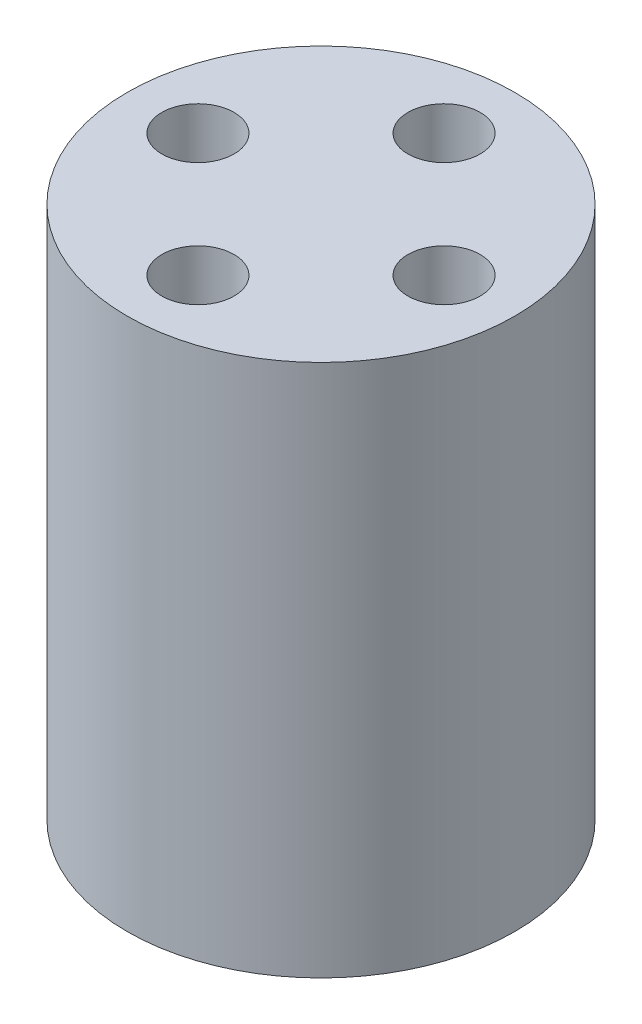
ISO-10303-21;
HEADER;
FILE_DESCRIPTION(('STEP AP214'),'2;1');
FILE_NAME('part.step','',(''),(''),'','','');
FILE_SCHEMA(('AUTOMOTIVE_DESIGN { 1 0 10303 214 1 1 1 1 }'));
ENDSEC;
DATA;
#1=APPLICATION_CONTEXT('core data for automotive mechanical design processes');
#2=APPLICATION_PROTOCOL_DEFINITION('international standard','automotive_design',2000,#1);
#3=PRODUCT_CONTEXT('',#1,'mechanical');
#4=PRODUCT('Part','Part','',(#3));
#5=PRODUCT_RELATED_PRODUCT_CATEGORY('part','',(#4));
#6=PRODUCT_DEFINITION_FORMATION('','',#4);
#7=PRODUCT_DEFINITION_CONTEXT('part definition',#1,'design');
#8=PRODUCT_DEFINITION('design','',#6,#7);
#9=PRODUCT_DEFINITION_SHAPE('','',#8);
#10=(LENGTH_UNIT() NAMED_UNIT(*) SI_UNIT(.MILLI.,.METRE.));
#11=(NAMED_UNIT(*) PLANE_ANGLE_UNIT() SI_UNIT($,.RADIAN.));
#12=(NAMED_UNIT(*) SI_UNIT($,.STERADIAN.) SOLID_ANGLE_UNIT());
#13=UNCERTAINTY_MEASURE_WITH_UNIT(LENGTH_MEASURE(1.E-05),#10,'distance_accuracy_value','');
#14=(GEOMETRIC_REPRESENTATION_CONTEXT(3) GLOBAL_UNCERTAINTY_ASSIGNED_CONTEXT((#13)) GLOBAL_UNIT_ASSIGNED_CONTEXT((#10,
#11,#12)) REPRESENTATION_CONTEXT('',''));
#15=CARTESIAN_POINT('',(0.,0.,0.));
#16=DIRECTION('',(0.,0.,1.));
#17=DIRECTION('',(1.,0.,0.));
#18=AXIS2_PLACEMENT_3D('',#15,#16,#17);
#19=CARTESIAN_POINT('',(0.,10.31494,0.));
#20=DIRECTION('',(0.,-1.,0.));
#21=DIRECTION('',(0.,0.,-1.));
#22=AXIS2_PLACEMENT_3D('',#19,#20,#21);
#23=CYLINDRICAL_SURFACE('',#22,7.5);
#24=CARTESIAN_POINT('',(0.,10.31494,0.));
#25=DIRECTION('',(0.,1.,0.));
#26=DIRECTION('',(0.,0.,1.));
#27=AXIS2_PLACEMENT_3D('',#24,#25,#26);
#28=CIRCLE('',#27,7.5);
#29=CARTESIAN_POINT('',(0.,10.31494,7.5));
#30=VERTEX_POINT('',#29);
#31=EDGE_CURVE('E10',#30,#30,#28,.T.);
#32=ORIENTED_EDGE('',*,*,#31,.F.);
#33=EDGE_LOOP('',(#32));
#34=FACE_BOUND('',#33,.T.);
#35=CARTESIAN_POINT('',(0.,-10.31494,0.));
#36=DIRECTION('',(0.,1.,0.));
#37=DIRECTION('',(0.,0.,1.));
#38=AXIS2_PLACEMENT_3D('',#35,#36,#37);
#39=CIRCLE('',#38,7.5);
#40=CARTESIAN_POINT('',(0.,-10.31494,7.5));
#41=VERTEX_POINT('',#40);
#42=EDGE_CURVE('E34',#41,#41,#39,.T.);
#43=ORIENTED_EDGE('',*,*,#42,.T.);
#44=EDGE_LOOP('',(#43));
#45=FACE_BOUND('',#44,.T.);
#46=ADVANCED_FACE('F31',(#34,#45),#23,.T.);
#47=CARTESIAN_POINT('',(0.,10.31494,0.));
#48=DIRECTION('',(0.,1.,0.));
#49=DIRECTION('',(0.,0.,1.));
#50=AXIS2_PLACEMENT_3D('',#47,#48,#49);
#51=PLANE('',#50);
#52=CARTESIAN_POINT('',(4.7625,10.31494,0.));
#53=DIRECTION('',(0.,1.,0.));
#54=DIRECTION('',(-1.,0.,0.));
#55=AXIS2_PLACEMENT_3D('',#52,#53,#54);
#56=CIRCLE('',#55,1.397);
#57=CARTESIAN_POINT('',(3.3655,10.31494,0.));
#58=VERTEX_POINT('',#57);
#59=EDGE_CURVE('E59',#58,#58,#56,.T.);
#60=ORIENTED_EDGE('',*,*,#59,.F.);
#61=EDGE_LOOP('',(#60));
#62=FACE_BOUND('',#61,.T.);
#63=CARTESIAN_POINT('',(0.,10.31494,4.7625));
#64=DIRECTION('',(0.,1.,0.));
#65=DIRECTION('',(0.,0.,-1.));
#66=AXIS2_PLACEMENT_3D('',#63,#64,#65);
#67=CIRCLE('',#66,1.397);
#68=CARTESIAN_POINT('',(0.,10.31494,3.3655));
#69=VERTEX_POINT('',#68);
#70=EDGE_CURVE('E52',#69,#69,#67,.T.);
#71=ORIENTED_EDGE('',*,*,#70,.F.);
#72=EDGE_LOOP('',(#71));
#73=FACE_BOUND('',#72,.T.);
#74=CARTESIAN_POINT('',(-4.7625,10.31494,0.));
#75=DIRECTION('',(0.,1.,0.));
#76=DIRECTION('',(1.,0.,0.));
#77=AXIS2_PLACEMENT_3D('',#74,#75,#76);
#78=CIRCLE('',#77,1.397);
#79=CARTESIAN_POINT('',(-3.3655,10.31494,0.));
#80=VERTEX_POINT('',#79);
#81=EDGE_CURVE('E53',#80,#80,#78,.T.);
#82=ORIENTED_EDGE('',*,*,#81,.F.);
#83=EDGE_LOOP('',(#82));
#84=FACE_BOUND('',#83,.T.);
#85=CARTESIAN_POINT('',(0.,10.31494,-4.7625));
#86=DIRECTION('',(0.,1.,0.));
#87=DIRECTION('',(0.,0.,1.));
#88=AXIS2_PLACEMENT_3D('',#85,#86,#87);
#89=CIRCLE('',#88,1.397);
#90=CARTESIAN_POINT('',(0.,10.31494,-3.3655));
#91=VERTEX_POINT('',#90);
#92=EDGE_CURVE('E45',#91,#91,#89,.T.);
#93=ORIENTED_EDGE('',*,*,#92,.F.);
#94=EDGE_LOOP('',(#93));
#95=FACE_BOUND('',#94,.T.);
#96=ORIENTED_EDGE('',*,*,#31,.T.);
#97=EDGE_LOOP('',(#96));
#98=FACE_BOUND('',#97,.T.);
#99=ADVANCED_FACE('F69',(#62,#73,#84,#95,#98),#51,.T.);
#100=CARTESIAN_POINT('',(0.,-10.31494,0.));
#101=DIRECTION('',(0.,1.,0.));
#102=DIRECTION('',(0.,0.,1.));
#103=AXIS2_PLACEMENT_3D('',#100,#101,#102);
#104=PLANE('',#103);
#105=CARTESIAN_POINT('',(4.7625,-10.31494,0.));
#106=DIRECTION('',(0.,1.,0.));
#107=DIRECTION('',(-1.,0.,0.));
#108=AXIS2_PLACEMENT_3D('',#105,#106,#107);
#109=CIRCLE('',#108,1.397);
#110=CARTESIAN_POINT('',(3.3655,-10.31494,0.));
#111=VERTEX_POINT('',#110);
#112=EDGE_CURVE('E48',#111,#111,#109,.T.);
#113=ORIENTED_EDGE('',*,*,#112,.T.);
#114=EDGE_LOOP('',(#113));
#115=FACE_BOUND('',#114,.T.);
#116=CARTESIAN_POINT('',(0.,-10.31494,4.7625));
#117=DIRECTION('',(0.,1.,0.));
#118=DIRECTION('',(0.,0.,-1.));
#119=AXIS2_PLACEMENT_3D('',#116,#117,#118);
#120=CIRCLE('',#119,1.397);
#121=CARTESIAN_POINT('',(0.,-10.31494,3.3655));
#122=VERTEX_POINT('',#121);
#123=EDGE_CURVE('E56',#122,#122,#120,.T.);
#124=ORIENTED_EDGE('',*,*,#123,.T.);
#125=EDGE_LOOP('',(#124));
#126=FACE_BOUND('',#125,.T.);
#127=CARTESIAN_POINT('',(-4.7625,-10.31494,0.));
#128=DIRECTION('',(0.,1.,0.));
#129=DIRECTION('',(1.,0.,0.));
#130=AXIS2_PLACEMENT_3D('',#127,#128,#129);
#131=CIRCLE('',#130,1.397);
#132=CARTESIAN_POINT('',(-3.3655,-10.31494,0.));
#133=VERTEX_POINT('',#132);
#134=EDGE_CURVE('E49',#133,#133,#131,.T.);
#135=ORIENTED_EDGE('',*,*,#134,.T.);
#136=EDGE_LOOP('',(#135));
#137=FACE_BOUND('',#136,.T.);
#138=CARTESIAN_POINT('',(0.,-10.31494,-4.7625));
#139=DIRECTION('',(0.,1.,0.));
#140=DIRECTION('',(0.,0.,1.));
#141=AXIS2_PLACEMENT_3D('',#138,#139,#140);
#142=CIRCLE('',#141,1.397);
#143=CARTESIAN_POINT('',(0.,-10.31494,-3.3655));
#144=VERTEX_POINT('',#143);
#145=EDGE_CURVE('E41',#144,#144,#142,.T.);
#146=ORIENTED_EDGE('',*,*,#145,.T.);
#147=EDGE_LOOP('',(#146));
#148=FACE_BOUND('',#147,.T.);
#149=ORIENTED_EDGE('',*,*,#42,.F.);
#150=EDGE_LOOP('',(#149));
#151=FACE_BOUND('',#150,.T.);
#152=ADVANCED_FACE('F72',(#115,#126,#137,#148,#151),#104,.F.);
#153=CARTESIAN_POINT('',(0.,-10.31494,-4.7625));
#154=DIRECTION('',(0.,1.,0.));
#155=DIRECTION('',(0.,0.,1.));
#156=AXIS2_PLACEMENT_3D('',#153,#154,#155);
#157=CYLINDRICAL_SURFACE('',#156,1.397);
#158=ORIENTED_EDGE('',*,*,#145,.F.);
#159=EDGE_LOOP('',(#158));
#160=FACE_BOUND('',#159,.T.);
#161=ORIENTED_EDGE('',*,*,#92,.T.);
#162=EDGE_LOOP('',(#161));
#163=FACE_BOUND('',#162,.T.);
#164=ADVANCED_FACE('F80',(#160,#163),#157,.F.);
#165=CARTESIAN_POINT('',(-4.7625,-10.31494,0.));
#166=DIRECTION('',(0.,1.,0.));
#167=DIRECTION('',(0.,0.,1.));
#168=AXIS2_PLACEMENT_3D('',#165,#166,#167);
#169=CYLINDRICAL_SURFACE('',#168,1.397);
#170=ORIENTED_EDGE('',*,*,#134,.F.);
#171=EDGE_LOOP('',(#170));
#172=FACE_BOUND('',#171,.T.);
#173=ORIENTED_EDGE('',*,*,#81,.T.);
#174=EDGE_LOOP('',(#173));
#175=FACE_BOUND('',#174,.T.);
#176=ADVANCED_FACE('F82',(#172,#175),#169,.F.);
#177=CARTESIAN_POINT('',(0.,-10.31494,4.7625));
#178=DIRECTION('',(0.,1.,0.));
#179=DIRECTION('',(0.,0.,1.));
#180=AXIS2_PLACEMENT_3D('',#177,#178,#179);
#181=CYLINDRICAL_SURFACE('',#180,1.397);
#182=ORIENTED_EDGE('',*,*,#123,.F.);
#183=EDGE_LOOP('',(#182));
#184=FACE_BOUND('',#183,.T.);
#185=ORIENTED_EDGE('',*,*,#70,.T.);
#186=EDGE_LOOP('',(#185));
#187=FACE_BOUND('',#186,.T.);
#188=ADVANCED_FACE('F89',(#184,#187),#181,.F.);
#189=CARTESIAN_POINT('',(4.7625,-10.31494,0.));
#190=DIRECTION('',(0.,1.,0.));
#191=DIRECTION('',(0.,0.,1.));
#192=AXIS2_PLACEMENT_3D('',#189,#190,#191);
#193=CYLINDRICAL_SURFACE('',#192,1.397);
#194=ORIENTED_EDGE('',*,*,#112,.F.);
#195=EDGE_LOOP('',(#194));
#196=FACE_BOUND('',#195,.T.);
#197=ORIENTED_EDGE('',*,*,#59,.T.);
#198=EDGE_LOOP('',(#197));
#199=FACE_BOUND('',#198,.T.);
#200=ADVANCED_FACE('F67',(#196,#199),#193,.F.);
#201=CLOSED_SHELL('',(#46,#99,#152,#164,#176,#188,#200));
#202=MANIFOLD_SOLID_BREP('B2',#201);
#203=ADVANCED_BREP_SHAPE_REPRESENTATION('',(#18,#202),#14);
#204=SHAPE_DEFINITION_REPRESENTATION(#9,#203);
ENDSEC;
END-ISO-10303-21;
